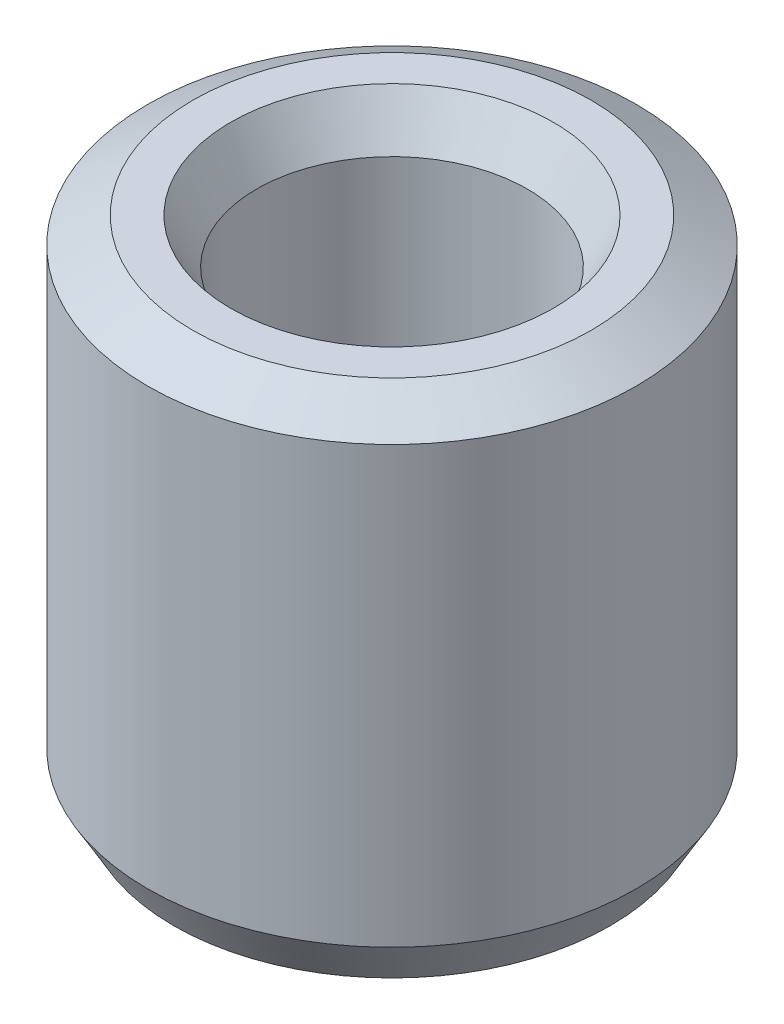
ISO-10303-21;
HEADER;
FILE_DESCRIPTION(('STEP AP214'),'2;1');
FILE_NAME('part.step','',(''),(''),'','','');
FILE_SCHEMA(('AUTOMOTIVE_DESIGN { 1 0 10303 214 1 1 1 1 }'));
ENDSEC;
DATA;
#1=APPLICATION_CONTEXT('core data for automotive mechanical design processes');
#2=APPLICATION_PROTOCOL_DEFINITION('international standard','automotive_design',2000,#1);
#3=PRODUCT_CONTEXT('',#1,'mechanical');
#4=PRODUCT('Part','Part','',(#3));
#5=PRODUCT_RELATED_PRODUCT_CATEGORY('part','',(#4));
#6=PRODUCT_DEFINITION_FORMATION('','',#4);
#7=PRODUCT_DEFINITION_CONTEXT('part definition',#1,'design');
#8=PRODUCT_DEFINITION('design','',#6,#7);
#9=PRODUCT_DEFINITION_SHAPE('','',#8);
#10=(LENGTH_UNIT() NAMED_UNIT(*) SI_UNIT(.MILLI.,.METRE.));
#11=(NAMED_UNIT(*) PLANE_ANGLE_UNIT() SI_UNIT($,.RADIAN.));
#12=(NAMED_UNIT(*) SI_UNIT($,.STERADIAN.) SOLID_ANGLE_UNIT());
#13=UNCERTAINTY_MEASURE_WITH_UNIT(LENGTH_MEASURE(1.E-05),#10,'distance_accuracy_value','');
#14=(GEOMETRIC_REPRESENTATION_CONTEXT(3) GLOBAL_UNCERTAINTY_ASSIGNED_CONTEXT((#13)) GLOBAL_UNIT_ASSIGNED_CONTEXT((#10,
#11,#12)) REPRESENTATION_CONTEXT('',''));
#15=CARTESIAN_POINT('',(0.,0.,0.));
#16=DIRECTION('',(0.,0.,1.));
#17=DIRECTION('',(1.,0.,0.));
#18=AXIS2_PLACEMENT_3D('',#15,#16,#17);
#19=CARTESIAN_POINT('',(0.,77.749401214529,0.));
#20=DIRECTION('',(0.,-1.,0.));
#21=DIRECTION('',(0.,0.,-1.));
#22=AXIS2_PLACEMENT_3D('',#19,#20,#21);
#23=CYLINDRICAL_SURFACE('',#22,37.5);
#24=CARTESIAN_POINT('',(0.,6.89593070203189,0.));
#25=DIRECTION('',(0.,1.,0.));
#26=DIRECTION('',(0.,0.,1.));
#27=AXIS2_PLACEMENT_3D('',#24,#25,#26);
#28=CIRCLE('',#27,37.5);
#29=CARTESIAN_POINT('',(0.,6.89593070203189,37.5));
#30=VERTEX_POINT('',#29);
#31=EDGE_CURVE('E10',#30,#30,#28,.T.);
#32=ORIENTED_EDGE('',*,*,#31,.T.);
#33=EDGE_LOOP('',(#32));
#34=FACE_BOUND('',#33,.T.);
#35=CARTESIAN_POINT('',(0.,73.7680337673978,0.));
#36=DIRECTION('',(0.,1.,0.));
#37=DIRECTION('',(0.,0.,1.));
#38=AXIS2_PLACEMENT_3D('',#35,#36,#37);
#39=CIRCLE('',#38,37.5);
#40=CARTESIAN_POINT('',(0.,73.7680337673978,37.5));
#41=VERTEX_POINT('',#40);
#42=EDGE_CURVE('E50',#41,#41,#39,.F.);
#43=ORIENTED_EDGE('',*,*,#42,.T.);
#44=EDGE_LOOP('',(#43));
#45=FACE_BOUND('',#44,.T.);
#46=ADVANCED_FACE('F39',(#34,#45),#23,.T.);
#47=CARTESIAN_POINT('',(0.,77.749401214529,0.));
#48=DIRECTION('',(0.,1.,0.));
#49=DIRECTION('',(0.,0.,1.));
#50=AXIS2_PLACEMENT_3D('',#47,#48,#49);
#51=PLANE('',#50);
#52=CARTESIAN_POINT('',(0.,77.749401214529,0.));
#53=DIRECTION('',(0.,1.,0.));
#54=DIRECTION('',(0.,0.,1.));
#55=AXIS2_PLACEMENT_3D('',#52,#53,#54);
#56=CIRCLE('',#55,24.7714030398205);
#57=CARTESIAN_POINT('',(0.,77.749401214529,24.7714030398205));
#58=VERTEX_POINT('',#57);
#59=EDGE_CURVE('E58',#58,#58,#56,.F.);
#60=ORIENTED_EDGE('',*,*,#59,.T.);
#61=EDGE_LOOP('',(#60));
#62=FACE_BOUND('',#61,.T.);
#63=CARTESIAN_POINT('',(0.,77.749401214529,0.));
#64=DIRECTION('',(0.,1.,0.));
#65=DIRECTION('',(0.,0.,1.));
#66=AXIS2_PLACEMENT_3D('',#63,#64,#65);
#67=CIRCLE('',#66,30.604069297968);
#68=CARTESIAN_POINT('',(0.,77.749401214529,30.604069297968));
#69=VERTEX_POINT('',#68);
#70=EDGE_CURVE('E61',#69,#69,#67,.T.);
#71=ORIENTED_EDGE('',*,*,#70,.T.);
#72=EDGE_LOOP('',(#71));
#73=FACE_BOUND('',#72,.T.);
#74=ADVANCED_FACE('F88',(#62,#73),#51,.T.);
#75=CARTESIAN_POINT('',(0.,0.,0.));
#76=DIRECTION('',(0.,1.,0.));
#77=DIRECTION('',(0.,0.,1.));
#78=AXIS2_PLACEMENT_3D('',#75,#76,#77);
#79=PLANE('',#78);
#80=CARTESIAN_POINT('',(0.,0.,0.));
#81=DIRECTION('',(0.,1.,0.));
#82=DIRECTION('',(0.,0.,1.));
#83=AXIS2_PLACEMENT_3D('',#80,#81,#82);
#84=CIRCLE('',#83,27.6859662947213);
#85=CARTESIAN_POINT('',(0.,0.,27.6859662947213));
#86=VERTEX_POINT('',#85);
#87=EDGE_CURVE('E51',#86,#86,#84,.T.);
#88=ORIENTED_EDGE('',*,*,#87,.T.);
#89=EDGE_LOOP('',(#88));
#90=FACE_BOUND('',#89,.T.);
#91=CARTESIAN_POINT('',(0.,0.,0.));
#92=DIRECTION('',(0.,1.,0.));
#93=DIRECTION('',(0.,0.,1.));
#94=AXIS2_PLACEMENT_3D('',#91,#92,#93);
#95=CIRCLE('',#94,33.5186325528688);
#96=CARTESIAN_POINT('',(0.,0.,33.5186325528688));
#97=VERTEX_POINT('',#96);
#98=EDGE_CURVE('E54',#97,#97,#95,.F.);
#99=ORIENTED_EDGE('',*,*,#98,.T.);
#100=EDGE_LOOP('',(#99));
#101=FACE_BOUND('',#100,.T.);
#102=ADVANCED_FACE('F83',(#90,#101),#79,.F.);
#103=CARTESIAN_POINT('',(0.,77.749401214529,0.));
#104=DIRECTION('',(0.,-1.,0.));
#105=DIRECTION('',(0.,0.,-1.));
#106=AXIS2_PLACEMENT_3D('',#103,#104,#105);
#107=CYLINDRICAL_SURFACE('',#106,20.7900355926893);
#108=CARTESIAN_POINT('',(0.,70.8534705124971,0.));
#109=DIRECTION('',(0.,1.,0.));
#110=DIRECTION('',(0.,0.,1.));
#111=AXIS2_PLACEMENT_3D('',#108,#109,#110);
#112=CIRCLE('',#111,20.7900355926893);
#113=CARTESIAN_POINT('',(0.,70.853470512497,20.7900355926893));
#114=VERTEX_POINT('',#113);
#115=EDGE_CURVE('E67',#114,#114,#112,.T.);
#116=ORIENTED_EDGE('',*,*,#115,.T.);
#117=EDGE_LOOP('',(#116));
#118=FACE_BOUND('',#117,.T.);
#119=CARTESIAN_POINT('',(0.,3.98136744713119,0.));
#120=DIRECTION('',(0.,1.,0.));
#121=DIRECTION('',(0.,0.,1.));
#122=AXIS2_PLACEMENT_3D('',#119,#120,#121);
#123=CIRCLE('',#122,20.7900355926893);
#124=CARTESIAN_POINT('',(0.,3.98136744713119,20.7900355926893));
#125=VERTEX_POINT('',#124);
#126=EDGE_CURVE('E69',#125,#125,#123,.F.);
#127=ORIENTED_EDGE('',*,*,#126,.T.);
#128=EDGE_LOOP('',(#127));
#129=FACE_BOUND('',#128,.T.);
#130=ADVANCED_FACE('F71',(#118,#129),#107,.F.);
#131=CARTESIAN_POINT('',(0.,70.8534705124971,0.));
#132=DIRECTION('',(0.,1.,0.));
#133=DIRECTION('',(0.,0.,1.));
#134=AXIS2_PLACEMENT_3D('',#131,#132,#133);
#135=CONICAL_SURFACE('',#134,20.7900355926893,0.523598775598304);
#136=CARTESIAN_POINT('',(0.,77.749401214529,24.7714030398205));
#137=CARTESIAN_POINT('',(0.,77.6775686030495,24.7299304622462));
#138=CARTESIAN_POINT('',(0.,77.60573599157,24.688457884672));
#139=CARTESIAN_POINT('',(0.,77.462070768611,24.6055127295234));
#140=CARTESIAN_POINT('',(0.,77.3902381571315,24.5640401519491));
#141=CARTESIAN_POINT('',(0.,77.2465729341725,24.4810949968005));
#142=CARTESIAN_POINT('',(0.,77.174740322693,24.4396224192263));
#143=CARTESIAN_POINT('',(0.,77.031075099734,24.3566772640777));
#144=CARTESIAN_POINT('',(0.,76.9592424882545,24.3152046865034));
#145=CARTESIAN_POINT('',(0.,76.8155772652955,24.2322595313548));
#146=CARTESIAN_POINT('',(0.,76.743744653816,24.1907869537806));
#147=CARTESIAN_POINT('',(0.,76.600079430857,24.107841798632));
#148=CARTESIAN_POINT('',(0.,76.5282468193775,24.0663692210577));
#149=CARTESIAN_POINT('',(0.,76.3845815964185,23.9834240659091));
#150=CARTESIAN_POINT('',(0.,76.312748984939,23.9419514883349));
#151=CARTESIAN_POINT('',(0.,76.16908376198,23.8590063331863));
#152=CARTESIAN_POINT('',(0.,76.0972511505005,23.817533755612));
#153=CARTESIAN_POINT('',(0.,75.9535859275415,23.7345886004634));
#154=CARTESIAN_POINT('',(0.,75.881753316062,23.6931160228892));
#155=CARTESIAN_POINT('',(0.,75.738088093103,23.6101708677406));
#156=CARTESIAN_POINT('',(0.,75.6662554816235,23.5686982901663));
#157=CARTESIAN_POINT('',(0.,75.5225902586645,23.4857531350177));
#158=CARTESIAN_POINT('',(0.,75.450757647185,23.4442805574435));
#159=CARTESIAN_POINT('',(0.,75.307092424226,23.3613354022949));
#160=CARTESIAN_POINT('',(0.,75.2352598127465,23.3198628247206));
#161=CARTESIAN_POINT('',(0.,75.0915945897875,23.236917669572));
#162=CARTESIAN_POINT('',(0.,75.019761978308,23.1954450919978));
#163=CARTESIAN_POINT('',(0.,74.876096755349,23.1124999368492));
#164=CARTESIAN_POINT('',(0.,74.8042641438695,23.0710273592749));
#165=CARTESIAN_POINT('',(0.,74.6605989209105,22.9880822041263));
#166=CARTESIAN_POINT('',(0.,74.588766309431,22.9466096265521));
#167=CARTESIAN_POINT('',(0.,74.445101086472,22.8636644714035));
#168=CARTESIAN_POINT('',(0.,74.3732684749925,22.8221918938292));
#169=CARTESIAN_POINT('',(0.,74.2296032520335,22.7392467386806));
#170=CARTESIAN_POINT('',(0.,74.157770640554,22.6977741611064));
#171=CARTESIAN_POINT('',(0.,74.014105417595,22.6148290059578));
#172=CARTESIAN_POINT('',(0.,73.9422728061155,22.5733564283835));
#173=CARTESIAN_POINT('',(0.,73.7986075831565,22.490411273235));
#174=CARTESIAN_POINT('',(0.,73.726774971677,22.4489386956607));
#175=CARTESIAN_POINT('',(0.,73.583109748718,22.3659935405121));
#176=CARTESIAN_POINT('',(0.,73.5112771372385,22.3245209629378));
#177=CARTESIAN_POINT('',(0.,73.3676119142795,22.2415758077893));
#178=CARTESIAN_POINT('',(0.,73.2957793028,22.200103230215));
#179=CARTESIAN_POINT('',(0.,73.152114079841,22.1171580750664));
#180=CARTESIAN_POINT('',(0.,73.0802814683615,22.0756854974921));
#181=CARTESIAN_POINT('',(0.,72.9366162454025,21.9927403423436));
#182=CARTESIAN_POINT('',(0.,72.864783633923,21.9512677647693));
#183=CARTESIAN_POINT('',(0.,72.721118410964,21.8683226096207));
#184=CARTESIAN_POINT('',(0.,72.6492857994845,21.8268500320464));
#185=CARTESIAN_POINT('',(0.,72.5056205765255,21.7439048768979));
#186=CARTESIAN_POINT('',(0.,72.433787965046,21.7024322993236));
#187=CARTESIAN_POINT('',(0.,72.290122742087,21.619487144175));
#188=CARTESIAN_POINT('',(0.,72.2182901306075,21.5780145666007));
#189=CARTESIAN_POINT('',(0.,72.0746249076485,21.4950694114522));
#190=CARTESIAN_POINT('',(0.,72.002792296169,21.4535968338779));
#191=CARTESIAN_POINT('',(0.,71.85912707321,21.3706516787293));
#192=CARTESIAN_POINT('',(0.,71.7872944617305,21.329179101155));
#193=CARTESIAN_POINT('',(0.,71.6436292387715,21.2462339460065));
#194=CARTESIAN_POINT('',(0.,71.571796627292,21.2047613684322));
#195=CARTESIAN_POINT('',(0.,71.428131404333,21.1218162132836));
#196=CARTESIAN_POINT('',(0.,71.3562987928536,21.0803436357093));
#197=CARTESIAN_POINT('',(0.,71.2126335698945,20.9973984805608));
#198=CARTESIAN_POINT('',(0.,71.140800958415,20.9559259029865));
#199=CARTESIAN_POINT('',(0.,70.997135735456,20.8729807478379));
#200=CARTESIAN_POINT('',(0.,70.9253031239766,20.8315081702636));
#201=CARTESIAN_POINT('',(0.,70.8534705124971,20.7900355926893));
#202=B_SPLINE_CURVE_WITH_KNOTS('',3,(#136,#137,#138,#139,#140,#141,#142,#143,#144,#145,#146,
#147,#148,#149,#150,#151,#152,#153,#154,#155,#156,#157,#158,#159,#160,#161,#162,#163,#164,#165,
#166,#167,#168,#169,#170,#171,#172,#173,#174,#175,#176,#177,#178,#179,#180,#181,#182,#183,#184,
#185,#186,#187,#188,#189,#190,#191,#192,#193,#194,#195,#196,#197,#198,#199,#200,#201),
.UNSPECIFIED.,.F.,.F.,(4,2,2,2,2,2,2,2,2,2,2,2,2,2,2,2,2,2,2,2,2,2,2,2,2,2,2,2,2,2,2,2,4),(0.,
0.248835465445698,0.497670930891396,0.746506396337095,0.995341861782793,1.24417732722848,
1.49301279267418,1.74184825811987,1.99068372356557,2.23951918901127,2.48835465445697,
2.73719011990265,2.98602558534835,3.23486105079405,3.48369651623975,3.73253198168545,
3.98136744713113,4.23020291257683,4.47903837802253,4.72787384346823,4.97670930891393,
5.22554477435963,5.47438023980531,5.72321570525101,5.97205117069671,6.22088663614241,
6.46972210158811,6.71855756703379,6.96739303247949,7.21622849792519,7.46506396337089,
7.71389942881659,7.96273489426227),.UNSPECIFIED.);
#203=EDGE_CURVE('BSEAM77',#58,#114,#202,.T.);
#204=ORIENTED_EDGE('',*,*,#59,.F.);
#205=ORIENTED_EDGE('',*,*,#115,.F.);
#206=ORIENTED_EDGE('',*,*,#203,.T.);
#207=ORIENTED_EDGE('',*,*,#203,.F.);
#208=EDGE_LOOP('',(#204,#206,#205,#207));
#209=FACE_BOUND('',#208,.T.);
#210=ADVANCED_FACE('F77',(#209),#135,.F.);
#211=CARTESIAN_POINT('',(0.,0.,0.));
#212=DIRECTION('',(0.,-1.,0.));
#213=DIRECTION('',(0.,0.,-1.));
#214=AXIS2_PLACEMENT_3D('',#211,#212,#213);
#215=CONICAL_SURFACE('',#214,27.6859662947213,1.04719755119659);
#216=ORIENTED_EDGE('',*,*,#126,.F.);
#217=EDGE_LOOP('',(#216));
#218=FACE_BOUND('',#217,.T.);
#219=ORIENTED_EDGE('',*,*,#87,.F.);
#220=EDGE_LOOP('',(#219));
#221=FACE_BOUND('',#220,.T.);
#222=ADVANCED_FACE('F73',(#218,#221),#215,.F.);
#223=CARTESIAN_POINT('',(0.,6.89593070203189,0.));
#224=DIRECTION('',(0.,1.,0.));
#225=DIRECTION('',(0.,0.,1.));
#226=AXIS2_PLACEMENT_3D('',#223,#224,#225);
#227=CONICAL_SURFACE('',#226,37.5,0.523598775598304);
#228=ORIENTED_EDGE('',*,*,#98,.F.);
#229=EDGE_LOOP('',(#228));
#230=FACE_BOUND('',#229,.T.);
#231=ORIENTED_EDGE('',*,*,#31,.F.);
#232=EDGE_LOOP('',(#231));
#233=FACE_BOUND('',#232,.T.);
#234=ADVANCED_FACE('F76',(#230,#233),#227,.T.);
#235=CARTESIAN_POINT('',(0.,77.749401214529,0.));
#236=DIRECTION('',(0.,-1.,0.));
#237=DIRECTION('',(0.,0.,-1.));
#238=AXIS2_PLACEMENT_3D('',#235,#236,#237);
#239=CONICAL_SURFACE('',#238,30.604069297968,1.04719755119659);
#240=ORIENTED_EDGE('',*,*,#42,.F.);
#241=EDGE_LOOP('',(#240));
#242=FACE_BOUND('',#241,.T.);
#243=ORIENTED_EDGE('',*,*,#70,.F.);
#244=EDGE_LOOP('',(#243));
#245=FACE_BOUND('',#244,.T.);
#246=ADVANCED_FACE('F45',(#242,#245),#239,.T.);
#247=CLOSED_SHELL('',(#46,#74,#102,#130,#210,#222,#234,#246));
#248=MANIFOLD_SOLID_BREP('B2',#247);
#249=ADVANCED_BREP_SHAPE_REPRESENTATION('',(#18,#248),#14);
#250=SHAPE_DEFINITION_REPRESENTATION(#9,#249);
ENDSEC;
END-ISO-10303-21;
